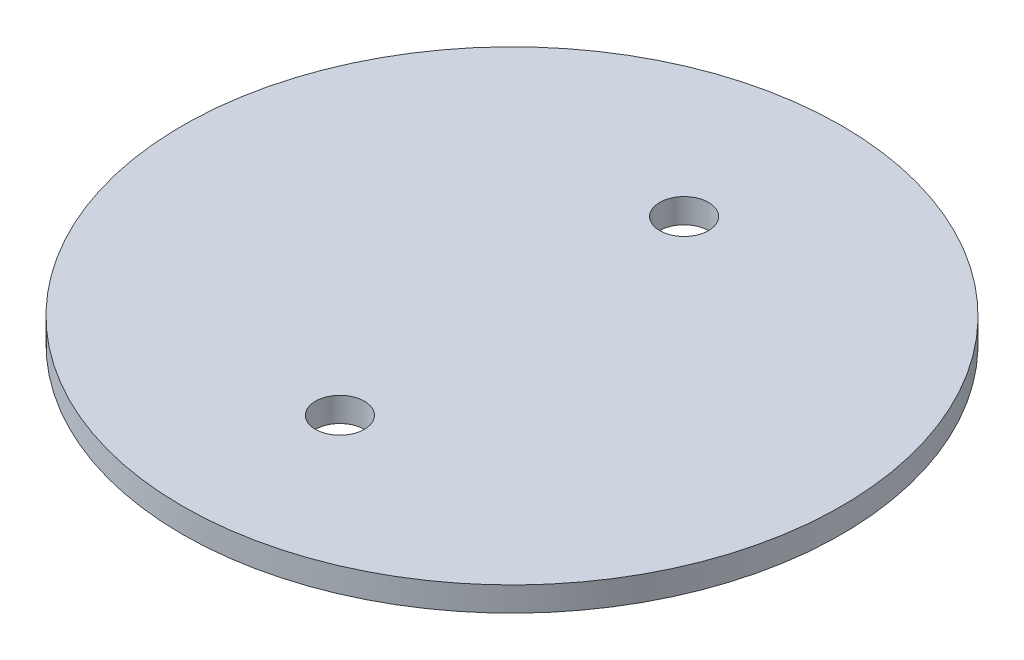
ISO-10303-21;
HEADER;
FILE_DESCRIPTION(('STEP AP214'),'2;1');
FILE_NAME('part.step','',(''),(''),'','','');
FILE_SCHEMA(('AUTOMOTIVE_DESIGN { 1 0 10303 214 1 1 1 1 }'));
ENDSEC;
DATA;
#1=APPLICATION_CONTEXT('core data for automotive mechanical design processes');
#2=APPLICATION_PROTOCOL_DEFINITION('international standard','automotive_design',2000,#1);
#3=PRODUCT_CONTEXT('',#1,'mechanical');
#4=PRODUCT('Part','Part','',(#3));
#5=PRODUCT_RELATED_PRODUCT_CATEGORY('part','',(#4));
#6=PRODUCT_DEFINITION_FORMATION('','',#4);
#7=PRODUCT_DEFINITION_CONTEXT('part definition',#1,'design');
#8=PRODUCT_DEFINITION('design','',#6,#7);
#9=PRODUCT_DEFINITION_SHAPE('','',#8);
#10=(LENGTH_UNIT() NAMED_UNIT(*) SI_UNIT(.MILLI.,.METRE.));
#11=(NAMED_UNIT(*) PLANE_ANGLE_UNIT() SI_UNIT($,.RADIAN.));
#12=(NAMED_UNIT(*) SI_UNIT($,.STERADIAN.) SOLID_ANGLE_UNIT());
#13=UNCERTAINTY_MEASURE_WITH_UNIT(LENGTH_MEASURE(1.E-05),#10,'distance_accuracy_value','');
#14=(GEOMETRIC_REPRESENTATION_CONTEXT(3) GLOBAL_UNCERTAINTY_ASSIGNED_CONTEXT((#13)) GLOBAL_UNIT_ASSIGNED_CONTEXT((#10,
#11,#12)) REPRESENTATION_CONTEXT('',''));
#15=CARTESIAN_POINT('',(0.,0.,0.));
#16=DIRECTION('',(0.,0.,1.));
#17=DIRECTION('',(1.,0.,0.));
#18=AXIS2_PLACEMENT_3D('',#15,#16,#17);
#19=CARTESIAN_POINT('',(0.,3.175,0.));
#20=DIRECTION('',(0.,-1.,0.));
#21=DIRECTION('',(0.,0.,-1.));
#22=AXIS2_PLACEMENT_3D('',#19,#20,#21);
#23=CYLINDRICAL_SURFACE('',#22,42.799);
#24=CARTESIAN_POINT('',(0.,3.175,0.));
#25=DIRECTION('',(0.,1.,0.));
#26=DIRECTION('',(0.,0.,1.));
#27=AXIS2_PLACEMENT_3D('',#24,#25,#26);
#28=CIRCLE('',#27,42.799);
#29=CARTESIAN_POINT('',(0.,3.175,42.799));
#30=VERTEX_POINT('',#29);
#31=EDGE_CURVE('E54',#30,#30,#28,.T.);
#32=ORIENTED_EDGE('',*,*,#31,.F.);
#33=EDGE_LOOP('',(#32));
#34=FACE_BOUND('',#33,.T.);
#35=CARTESIAN_POINT('',(0.,0.,0.));
#36=DIRECTION('',(0.,1.,0.));
#37=DIRECTION('',(0.,0.,1.));
#38=AXIS2_PLACEMENT_3D('',#35,#36,#37);
#39=CIRCLE('',#38,42.799);
#40=CARTESIAN_POINT('',(0.,0.,42.799));
#41=VERTEX_POINT('',#40);
#42=EDGE_CURVE('E67',#41,#41,#39,.T.);
#43=ORIENTED_EDGE('',*,*,#42,.T.);
#44=EDGE_LOOP('',(#43));
#45=FACE_BOUND('',#44,.T.);
#46=ADVANCED_FACE('F45',(#34,#45),#23,.T.);
#47=CARTESIAN_POINT('',(0.,3.175,22.352));
#48=DIRECTION('',(0.,-1.,0.));
#49=DIRECTION('',(0.,0.,-1.));
#50=AXIS2_PLACEMENT_3D('',#47,#48,#49);
#51=CYLINDRICAL_SURFACE('',#50,3.175);
#52=CARTESIAN_POINT('',(0.,3.175,22.352));
#53=DIRECTION('',(0.,1.,0.));
#54=DIRECTION('',(0.,0.,1.));
#55=AXIS2_PLACEMENT_3D('',#52,#53,#54);
#56=CIRCLE('',#55,3.175);
#57=CARTESIAN_POINT('',(0.,3.175,25.527));
#58=VERTEX_POINT('',#57);
#59=EDGE_CURVE('E60',#58,#58,#56,.T.);
#60=ORIENTED_EDGE('',*,*,#59,.T.);
#61=EDGE_LOOP('',(#60));
#62=FACE_BOUND('',#61,.T.);
#63=CARTESIAN_POINT('',(0.,0.,22.352));
#64=DIRECTION('',(0.,1.,0.));
#65=DIRECTION('',(0.,0.,1.));
#66=AXIS2_PLACEMENT_3D('',#63,#64,#65);
#67=CIRCLE('',#66,3.175);
#68=CARTESIAN_POINT('',(0.,0.,25.527));
#69=VERTEX_POINT('',#68);
#70=EDGE_CURVE('E64',#69,#69,#67,.T.);
#71=ORIENTED_EDGE('',*,*,#70,.F.);
#72=EDGE_LOOP('',(#71));
#73=FACE_BOUND('',#72,.T.);
#74=ADVANCED_FACE('F47',(#62,#73),#51,.F.);
#75=CARTESIAN_POINT('',(0.,3.175,-22.352));
#76=DIRECTION('',(0.,-1.,0.));
#77=DIRECTION('',(0.,0.,-1.));
#78=AXIS2_PLACEMENT_3D('',#75,#76,#77);
#79=CYLINDRICAL_SURFACE('',#78,3.175);
#80=CARTESIAN_POINT('',(0.,3.175,-22.352));
#81=DIRECTION('',(0.,1.,0.));
#82=DIRECTION('',(0.,0.,1.));
#83=AXIS2_PLACEMENT_3D('',#80,#81,#82);
#84=CIRCLE('',#83,3.175);
#85=CARTESIAN_POINT('',(0.,3.175,-19.177));
#86=VERTEX_POINT('',#85);
#87=EDGE_CURVE('E10',#86,#86,#84,.F.);
#88=ORIENTED_EDGE('',*,*,#87,.F.);
#89=EDGE_LOOP('',(#88));
#90=FACE_BOUND('',#89,.T.);
#91=CARTESIAN_POINT('',(0.,0.,-22.352));
#92=DIRECTION('',(0.,1.,0.));
#93=DIRECTION('',(0.,0.,1.));
#94=AXIS2_PLACEMENT_3D('',#91,#92,#93);
#95=CIRCLE('',#94,3.175);
#96=CARTESIAN_POINT('',(0.,0.,-19.177));
#97=VERTEX_POINT('',#96);
#98=EDGE_CURVE('E49',#97,#97,#95,.F.);
#99=ORIENTED_EDGE('',*,*,#98,.T.);
#100=EDGE_LOOP('',(#99));
#101=FACE_BOUND('',#100,.T.);
#102=ADVANCED_FACE('F86',(#90,#101),#79,.F.);
#103=CARTESIAN_POINT('',(0.,3.175,0.));
#104=DIRECTION('',(0.,1.,0.));
#105=DIRECTION('',(0.,0.,1.));
#106=AXIS2_PLACEMENT_3D('',#103,#104,#105);
#107=PLANE('',#106);
#108=ORIENTED_EDGE('',*,*,#59,.F.);
#109=EDGE_LOOP('',(#108));
#110=FACE_BOUND('',#109,.T.);
#111=ORIENTED_EDGE('',*,*,#31,.T.);
#112=EDGE_LOOP('',(#111));
#113=FACE_BOUND('',#112,.T.);
#114=ORIENTED_EDGE('',*,*,#87,.T.);
#115=EDGE_LOOP('',(#114));
#116=FACE_BOUND('',#115,.T.);
#117=ADVANCED_FACE('F82',(#110,#113,#116),#107,.T.);
#118=CARTESIAN_POINT('',(0.,0.,0.));
#119=DIRECTION('',(0.,1.,0.));
#120=DIRECTION('',(0.,0.,1.));
#121=AXIS2_PLACEMENT_3D('',#118,#119,#120);
#122=PLANE('',#121);
#123=ORIENTED_EDGE('',*,*,#70,.T.);
#124=EDGE_LOOP('',(#123));
#125=FACE_BOUND('',#124,.T.);
#126=ORIENTED_EDGE('',*,*,#42,.F.);
#127=EDGE_LOOP('',(#126));
#128=FACE_BOUND('',#127,.T.);
#129=ORIENTED_EDGE('',*,*,#98,.F.);
#130=EDGE_LOOP('',(#129));
#131=FACE_BOUND('',#130,.T.);
#132=ADVANCED_FACE('F85',(#125,#128,#131),#122,.F.);
#133=CLOSED_SHELL('',(#46,#74,#102,#117,#132));
#134=MANIFOLD_SOLID_BREP('B2',#133);
#135=ADVANCED_BREP_SHAPE_REPRESENTATION('',(#18,#134),#14);
#136=SHAPE_DEFINITION_REPRESENTATION(#9,#135);
ENDSEC;
END-ISO-10303-21;
